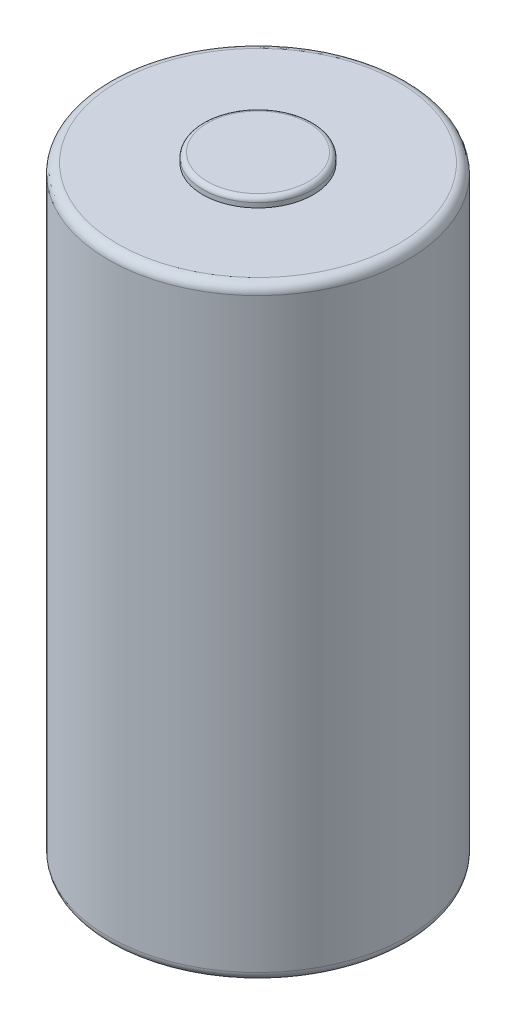
ISO-10303-21;
HEADER;
FILE_DESCRIPTION(('STEP AP214'),'2;1');
FILE_NAME('part.step','',(''),(''),'','','');
FILE_SCHEMA(('AUTOMOTIVE_DESIGN { 1 0 10303 214 1 1 1 1 }'));
ENDSEC;
DATA;
#1=APPLICATION_CONTEXT('core data for automotive mechanical design processes');
#2=APPLICATION_PROTOCOL_DEFINITION('international standard','automotive_design',2000,#1);
#3=PRODUCT_CONTEXT('',#1,'mechanical');
#4=PRODUCT('Part','Part','',(#3));
#5=PRODUCT_RELATED_PRODUCT_CATEGORY('part','',(#4));
#6=PRODUCT_DEFINITION_FORMATION('','',#4);
#7=PRODUCT_DEFINITION_CONTEXT('part definition',#1,'design');
#8=PRODUCT_DEFINITION('design','',#6,#7);
#9=PRODUCT_DEFINITION_SHAPE('','',#8);
#10=(LENGTH_UNIT() NAMED_UNIT(*) SI_UNIT(.MILLI.,.METRE.));
#11=(NAMED_UNIT(*) PLANE_ANGLE_UNIT() SI_UNIT($,.RADIAN.));
#12=(NAMED_UNIT(*) SI_UNIT($,.STERADIAN.) SOLID_ANGLE_UNIT());
#13=UNCERTAINTY_MEASURE_WITH_UNIT(LENGTH_MEASURE(1.E-05),#10,'distance_accuracy_value','');
#14=(GEOMETRIC_REPRESENTATION_CONTEXT(3) GLOBAL_UNCERTAINTY_ASSIGNED_CONTEXT((#13)) GLOBAL_UNIT_ASSIGNED_CONTEXT((#10,
#11,#12)) REPRESENTATION_CONTEXT('',''));
#15=CARTESIAN_POINT('',(0.,0.,0.));
#16=DIRECTION('',(0.,0.,1.));
#17=DIRECTION('',(1.,0.,0.));
#18=AXIS2_PLACEMENT_3D('',#15,#16,#17);
#19=CARTESIAN_POINT('',(0.,33.3756,0.));
#20=DIRECTION('',(0.,-1.,0.));
#21=DIRECTION('',(0.,0.,-1.));
#22=AXIS2_PLACEMENT_3D('',#19,#20,#21);
#23=CYLINDRICAL_SURFACE('',#22,8.255);
#24=CARTESIAN_POINT('',(0.,0.508000000000002,0.));
#25=DIRECTION('',(0.,1.,0.));
#26=DIRECTION('',(0.,0.,1.));
#27=AXIS2_PLACEMENT_3D('',#24,#25,#26);
#28=CIRCLE('',#27,8.255);
#29=CARTESIAN_POINT('',(0.,0.508000000000002,8.255));
#30=VERTEX_POINT('',#29);
#31=EDGE_CURVE('E55',#30,#30,#28,.T.);
#32=ORIENTED_EDGE('',*,*,#31,.T.);
#33=EDGE_LOOP('',(#32));
#34=FACE_BOUND('',#33,.T.);
#35=CARTESIAN_POINT('',(0.,32.8676,0.));
#36=DIRECTION('',(0.,1.,0.));
#37=DIRECTION('',(0.,0.,1.));
#38=AXIS2_PLACEMENT_3D('',#35,#36,#37);
#39=CIRCLE('',#38,8.255);
#40=CARTESIAN_POINT('',(0.,32.8676,8.255));
#41=VERTEX_POINT('',#40);
#42=EDGE_CURVE('E58',#41,#41,#39,.F.);
#43=ORIENTED_EDGE('',*,*,#42,.T.);
#44=EDGE_LOOP('',(#43));
#45=FACE_BOUND('',#44,.T.);
#46=ADVANCED_FACE('F35',(#34,#45),#23,.T.);
#47=CARTESIAN_POINT('',(0.,33.3756,0.));
#48=DIRECTION('',(0.,1.,0.));
#49=DIRECTION('',(0.,0.,1.));
#50=AXIS2_PLACEMENT_3D('',#47,#48,#49);
#51=PLANE('',#50);
#52=CARTESIAN_POINT('',(0.,33.3756,0.));
#53=DIRECTION('',(0.,1.,0.));
#54=DIRECTION('',(0.,0.,1.));
#55=AXIS2_PLACEMENT_3D('',#52,#53,#54);
#56=CIRCLE('',#55,7.747);
#57=CARTESIAN_POINT('',(0.,33.3756,7.747));
#58=VERTEX_POINT('',#57);
#59=EDGE_CURVE('E46',#58,#58,#56,.T.);
#60=ORIENTED_EDGE('',*,*,#59,.T.);
#61=EDGE_LOOP('',(#60));
#62=FACE_BOUND('',#61,.T.);
#63=CARTESIAN_POINT('',(0.,33.3756,0.));
#64=DIRECTION('',(0.,1.,0.));
#65=DIRECTION('',(0.,0.,1.));
#66=AXIS2_PLACEMENT_3D('',#63,#64,#65);
#67=CIRCLE('',#66,3.048);
#68=CARTESIAN_POINT('',(0.,33.3756,3.048));
#69=VERTEX_POINT('',#68);
#70=EDGE_CURVE('E64',#69,#69,#67,.T.);
#71=ORIENTED_EDGE('',*,*,#70,.F.);
#72=EDGE_LOOP('',(#71));
#73=FACE_BOUND('',#72,.T.);
#74=ADVANCED_FACE('F83',(#62,#73),#51,.T.);
#75=CARTESIAN_POINT('',(0.,0.,0.));
#76=DIRECTION('',(0.,1.,0.));
#77=DIRECTION('',(0.,0.,1.));
#78=AXIS2_PLACEMENT_3D('',#75,#76,#77);
#79=PLANE('',#78);
#80=CARTESIAN_POINT('',(0.,0.,0.));
#81=DIRECTION('',(0.,1.,0.));
#82=DIRECTION('',(0.,0.,1.));
#83=AXIS2_PLACEMENT_3D('',#80,#81,#82);
#84=CIRCLE('',#83,7.747);
#85=CARTESIAN_POINT('',(0.,0.,7.747));
#86=VERTEX_POINT('',#85);
#87=EDGE_CURVE('E50',#86,#86,#84,.F.);
#88=ORIENTED_EDGE('',*,*,#87,.T.);
#89=EDGE_LOOP('',(#88));
#90=FACE_BOUND('',#89,.T.);
#91=CARTESIAN_POINT('',(0.,0.,0.));
#92=DIRECTION('',(0.,1.,0.));
#93=DIRECTION('',(0.,0.,1.));
#94=AXIS2_PLACEMENT_3D('',#91,#92,#93);
#95=CIRCLE('',#94,5.08);
#96=CARTESIAN_POINT('',(0.,0.,5.08));
#97=VERTEX_POINT('',#96);
#98=EDGE_CURVE('E61',#97,#97,#95,.F.);
#99=ORIENTED_EDGE('',*,*,#98,.F.);
#100=EDGE_LOOP('',(#99));
#101=FACE_BOUND('',#100,.T.);
#102=ADVANCED_FACE('F80',(#90,#101),#79,.F.);
#103=CARTESIAN_POINT('',(0.,33.8836,0.));
#104=DIRECTION('',(0.,-1.,0.));
#105=DIRECTION('',(0.,0.,-1.));
#106=AXIS2_PLACEMENT_3D('',#103,#104,#105);
#107=CYLINDRICAL_SURFACE('',#106,3.048);
#108=CARTESIAN_POINT('',(0.,33.6296,0.));
#109=DIRECTION('',(0.,1.,0.));
#110=DIRECTION('',(0.,0.,1.));
#111=AXIS2_PLACEMENT_3D('',#108,#109,#110);
#112=CIRCLE('',#111,3.048);
#113=CARTESIAN_POINT('',(0.,33.6296,3.048));
#114=VERTEX_POINT('',#113);
#115=EDGE_CURVE('E10',#114,#114,#112,.F.);
#116=ORIENTED_EDGE('',*,*,#115,.T.);
#117=EDGE_LOOP('',(#116));
#118=FACE_BOUND('',#117,.T.);
#119=ORIENTED_EDGE('',*,*,#70,.T.);
#120=EDGE_LOOP('',(#119));
#121=FACE_BOUND('',#120,.T.);
#122=ADVANCED_FACE('F82',(#118,#121),#107,.T.);
#123=CARTESIAN_POINT('',(0.,33.8836,0.));
#124=DIRECTION('',(0.,1.,0.));
#125=DIRECTION('',(0.,0.,1.));
#126=AXIS2_PLACEMENT_3D('',#123,#124,#125);
#127=PLANE('',#126);
#128=CARTESIAN_POINT('',(0.,33.8836,0.));
#129=DIRECTION('',(0.,1.,0.));
#130=DIRECTION('',(0.,0.,1.));
#131=AXIS2_PLACEMENT_3D('',#128,#129,#130);
#132=CIRCLE('',#131,2.794);
#133=CARTESIAN_POINT('',(0.,33.8836,2.794));
#134=VERTEX_POINT('',#133);
#135=EDGE_CURVE('E42',#134,#134,#132,.T.);
#136=ORIENTED_EDGE('',*,*,#135,.T.);
#137=EDGE_LOOP('',(#136));
#138=FACE_BOUND('',#137,.T.);
#139=ADVANCED_FACE('F76',(#138),#127,.T.);
#140=CARTESIAN_POINT('',(0.,-0.1016,0.));
#141=DIRECTION('',(0.,1.,0.));
#142=DIRECTION('',(0.,0.,1.));
#143=AXIS2_PLACEMENT_3D('',#140,#141,#142);
#144=CYLINDRICAL_SURFACE('',#143,5.08);
#145=CARTESIAN_POINT('',(0.,-0.1016,0.));
#146=DIRECTION('',(0.,-1.,0.));
#147=DIRECTION('',(0.,0.,-1.));
#148=AXIS2_PLACEMENT_3D('',#145,#146,#147);
#149=CIRCLE('',#148,5.08);
#150=CARTESIAN_POINT('',(0.,-0.1016,-5.08));
#151=VERTEX_POINT('',#150);
#152=EDGE_CURVE('E67',#151,#151,#149,.T.);
#153=ORIENTED_EDGE('',*,*,#152,.F.);
#154=EDGE_LOOP('',(#153));
#155=FACE_BOUND('',#154,.T.);
#156=ORIENTED_EDGE('',*,*,#98,.T.);
#157=EDGE_LOOP('',(#156));
#158=FACE_BOUND('',#157,.T.);
#159=ADVANCED_FACE('F73',(#155,#158),#144,.T.);
#160=CARTESIAN_POINT('',(0.,-0.1016,0.));
#161=DIRECTION('',(0.,-1.,0.));
#162=DIRECTION('',(0.,0.,-1.));
#163=AXIS2_PLACEMENT_3D('',#160,#161,#162);
#164=PLANE('',#163);
#165=ORIENTED_EDGE('',*,*,#152,.T.);
#166=EDGE_LOOP('',(#165));
#167=FACE_BOUND('',#166,.T.);
#168=ADVANCED_FACE('F71',(#167),#164,.T.);
#169=CARTESIAN_POINT('',(0.,0.508000000000002,0.));
#170=DIRECTION('',(0.,1.,0.));
#171=DIRECTION('',(0.,0.,1.));
#172=AXIS2_PLACEMENT_3D('',#169,#170,#171);
#173=TOROIDAL_SURFACE('',#172,7.747,0.508);
#174=ORIENTED_EDGE('',*,*,#87,.F.);
#175=EDGE_LOOP('',(#174));
#176=FACE_BOUND('',#175,.T.);
#177=ORIENTED_EDGE('',*,*,#31,.F.);
#178=EDGE_LOOP('',(#177));
#179=FACE_BOUND('',#178,.T.);
#180=ADVANCED_FACE('F100',(#176,#179),#173,.T.);
#181=CARTESIAN_POINT('',(0.,32.8676,0.));
#182=DIRECTION('',(0.,1.,0.));
#183=DIRECTION('',(0.,0.,1.));
#184=AXIS2_PLACEMENT_3D('',#181,#182,#183);
#185=TOROIDAL_SURFACE('',#184,7.747,0.508);
#186=ORIENTED_EDGE('',*,*,#42,.F.);
#187=EDGE_LOOP('',(#186));
#188=FACE_BOUND('',#187,.T.);
#189=ORIENTED_EDGE('',*,*,#59,.F.);
#190=EDGE_LOOP('',(#189));
#191=FACE_BOUND('',#190,.T.);
#192=ADVANCED_FACE('F102',(#188,#191),#185,.T.);
#193=CARTESIAN_POINT('',(0.,33.6296,0.));
#194=DIRECTION('',(0.,1.,0.));
#195=DIRECTION('',(0.,0.,1.));
#196=AXIS2_PLACEMENT_3D('',#193,#194,#195);
#197=TOROIDAL_SURFACE('',#196,2.794,0.254);
#198=ORIENTED_EDGE('',*,*,#115,.F.);
#199=EDGE_LOOP('',(#198));
#200=FACE_BOUND('',#199,.T.);
#201=ORIENTED_EDGE('',*,*,#135,.F.);
#202=EDGE_LOOP('',(#201));
#203=FACE_BOUND('',#202,.T.);
#204=ADVANCED_FACE('F37',(#200,#203),#197,.T.);
#205=CLOSED_SHELL('',(#46,#74,#102,#122,#139,#159,#168,#180,#192,#204));
#206=MANIFOLD_SOLID_BREP('B2',#205);
#207=ADVANCED_BREP_SHAPE_REPRESENTATION('',(#18,#206),#14);
#208=SHAPE_DEFINITION_REPRESENTATION(#9,#207);
ENDSEC;
END-ISO-10303-21;
